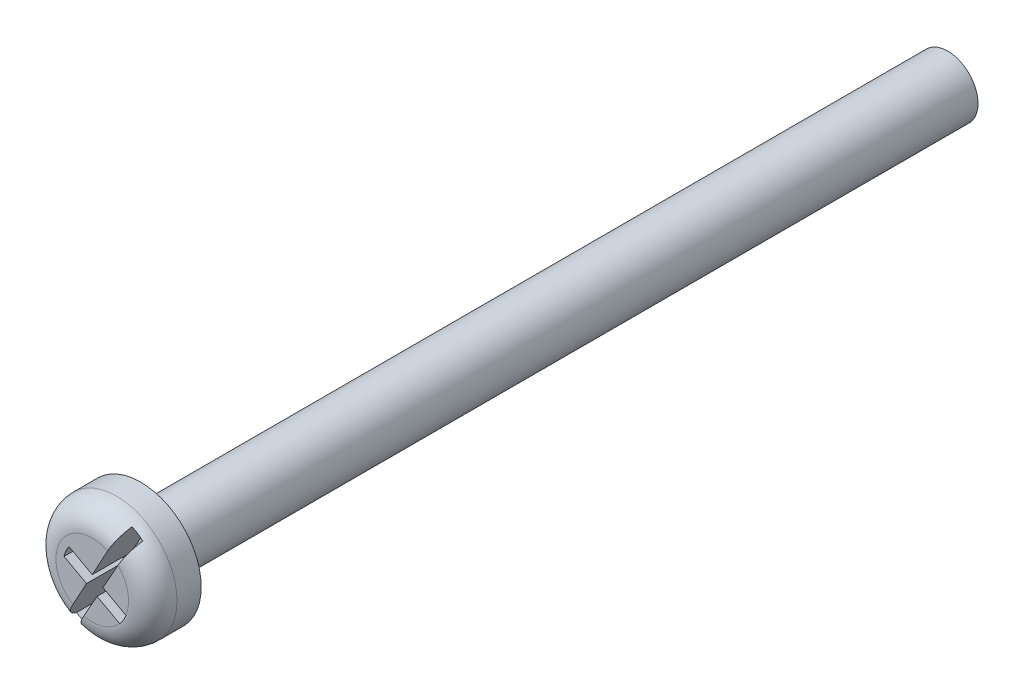
ISO-10303-21;
HEADER;
FILE_DESCRIPTION(('STEP AP214'),'2;1');
FILE_NAME('part.step','',(''),(''),'','','');
FILE_SCHEMA(('AUTOMOTIVE_DESIGN { 1 0 10303 214 1 1 1 1 }'));
ENDSEC;
DATA;
#1=APPLICATION_CONTEXT('core data for automotive mechanical design processes');
#2=APPLICATION_PROTOCOL_DEFINITION('international standard','automotive_design',2000,#1);
#3=PRODUCT_CONTEXT('',#1,'mechanical');
#4=PRODUCT('Part','Part','',(#3));
#5=PRODUCT_RELATED_PRODUCT_CATEGORY('part','',(#4));
#6=PRODUCT_DEFINITION_FORMATION('','',#4);
#7=PRODUCT_DEFINITION_CONTEXT('part definition',#1,'design');
#8=PRODUCT_DEFINITION('design','',#6,#7);
#9=PRODUCT_DEFINITION_SHAPE('','',#8);
#10=(LENGTH_UNIT() NAMED_UNIT(*) SI_UNIT(.MILLI.,.METRE.));
#11=(NAMED_UNIT(*) PLANE_ANGLE_UNIT() SI_UNIT($,.RADIAN.));
#12=(NAMED_UNIT(*) SI_UNIT($,.STERADIAN.) SOLID_ANGLE_UNIT());
#13=UNCERTAINTY_MEASURE_WITH_UNIT(LENGTH_MEASURE(1.E-05),#10,'distance_accuracy_value','');
#14=(GEOMETRIC_REPRESENTATION_CONTEXT(3) GLOBAL_UNCERTAINTY_ASSIGNED_CONTEXT((#13)) GLOBAL_UNIT_ASSIGNED_CONTEXT((#10,
#11,#12)) REPRESENTATION_CONTEXT('',''));
#15=CARTESIAN_POINT('',(0.,0.,0.));
#16=DIRECTION('',(0.,0.,1.));
#17=DIRECTION('',(1.,0.,0.));
#18=AXIS2_PLACEMENT_3D('',#15,#16,#17);
#19=CARTESIAN_POINT('',(-1.86051624597212,2.73214285714287,2.4));
#20=DIRECTION('',(0.,0.,1.));
#21=DIRECTION('',(1.,0.,0.));
#22=AXIS2_PLACEMENT_3D('',#19,#20,#21);
#23=PLANE('',#22);
#24=DIRECTION('',(-0.478292119632489,-0.87820080180871,0.));
#25=VECTOR('',#24,1.);
#26=CARTESIAN_POINT('',(-3.33454353016391,0.250826496084395,2.4));
#27=LINE('',#26,#25);
#28=CARTESIAN_POINT('',(-2.14514294385762,2.43470640062586,2.4));
#29=VERTEX_POINT('',#28);
#30=CARTESIAN_POINT('',(-2.8144800366458,1.20572447213714,2.4));
#31=VERTEX_POINT('',#30);
#32=EDGE_CURVE('E166',#29,#31,#27,.T.);
#33=ORIENTED_EDGE('',*,*,#32,.F.);
#34=DIRECTION('',(0.877616803209732,-0.479362854968896,0.));
#35=VECTOR('',#34,1.);
#36=CARTESIAN_POINT('',(-2.14514294385762,2.43470640062586,2.4));
#37=LINE('',#36,#35);
#38=CARTESIAN_POINT('',(-3.25868789679237,3.04293551135249,2.4));
#39=VERTEX_POINT('',#38);
#40=EDGE_CURVE('E168',#39,#29,#37,.T.);
#41=ORIENTED_EDGE('',*,*,#40,.F.);
#42=CARTESIAN_POINT('',(-1.86051624597212,2.73214285714287,2.4));
#43=DIRECTION('',(0.,0.,1.));
#44=DIRECTION('',(1.,0.,0.));
#45=AXIS2_PLACEMENT_3D('',#42,#43,#44);
#46=CIRCLE('',#45,1.43229746877807);
#47=CARTESIAN_POINT('',(-3.00946383602339,3.58735948138695,2.4));
#48=VERTEX_POINT('',#47);
#49=EDGE_CURVE('E209',#48,#39,#46,.T.);
#50=ORIENTED_EDGE('',*,*,#49,.F.);
#51=DIRECTION('',(-0.87756139574922,0.479464280933086,0.));
#52=VECTOR('',#51,1.);
#53=CARTESIAN_POINT('',(-1.85954831796557,2.95909185285404,2.4));
#54=LINE('',#53,#52);
#55=CARTESIAN_POINT('',(-1.85954831796557,2.95909185285404,2.4));
#56=VERTEX_POINT('',#55);
#57=EDGE_CURVE('E206',#56,#48,#54,.T.);
#58=ORIENTED_EDGE('',*,*,#57,.F.);
#59=DIRECTION('',(-0.478292119632489,-0.87820080180871,0.));
#60=VECTOR('',#59,1.);
#61=CARTESIAN_POINT('',(-1.85954831796557,2.95909185285404,2.4));
#62=LINE('',#61,#60);
#63=CARTESIAN_POINT('',(-1.09571318629089,4.36158333776873,2.4));
#64=VERTEX_POINT('',#63);
#65=EDGE_CURVE('E204',#64,#56,#62,.T.);
#66=ORIENTED_EDGE('',*,*,#65,.F.);
#67=CARTESIAN_POINT('',(-1.86051624597212,2.73214285714287,2.4));
#68=DIRECTION('',(0.,0.,1.));
#69=DIRECTION('',(1.,0.,0.));
#70=AXIS2_PLACEMENT_3D('',#67,#68,#69);
#71=CIRCLE('',#70,1.8);
#72=EDGE_CURVE('E254',#64,#31,#71,.T.);
#73=ORIENTED_EDGE('',*,*,#72,.T.);
#74=EDGE_LOOP('',(#33,#41,#50,#58,#66,#73));
#75=FACE_BOUND('',#74,.T.);
#76=ADVANCED_FACE('F34',(#75),#23,.T.);
#77=DIRECTION('',(0.488945551082672,0.872314305784596,0.));
#78=VECTOR('',#77,1.);
#79=CARTESIAN_POINT('',(-1.32937302466549,2.66942537823253,2.4));
#80=LINE('',#79,#78);
#81=CARTESIAN_POINT('',(-1.32937302466549,2.66942537823253,2.4));
#82=VERTEX_POINT('',#81);
#83=CARTESIAN_POINT('',(-0.583292168991765,4.00048770661469,2.4));
#84=VERTEX_POINT('',#83);
#85=EDGE_CURVE('E202',#82,#84,#80,.T.);
#86=ORIENTED_EDGE('',*,*,#85,.F.);
#87=DIRECTION('',(-0.87756139574922,0.479464280933086,0.));
#88=VECTOR('',#87,1.);
#89=CARTESIAN_POINT('',(-0.183967514701797,2.04362183688296,2.4));
#90=LINE('',#89,#88);
#91=CARTESIAN_POINT('',(-0.194936591049152,2.04961489939557,2.4));
#92=VERTEX_POINT('',#91);
#93=EDGE_CURVE('E200',#92,#82,#90,.T.);
#94=ORIENTED_EDGE('',*,*,#93,.F.);
#95=EDGE_CURVE('E250',#92,#84,#71,.T.);
#96=ORIENTED_EDGE('',*,*,#95,.T.);
#97=EDGE_LOOP('',(#86,#94,#96));
#98=FACE_BOUND('',#97,.T.);
#99=ADVANCED_FACE('F289',(#98),#23,.T.);
#100=CARTESIAN_POINT('',(-1.86051624597212,2.73214285714287,2.4));
#101=DIRECTION('',(0.,0.,-1.));
#102=DIRECTION('',(-1.,0.,0.));
#103=AXIS2_PLACEMENT_3D('',#100,#101,#102);
#104=CYLINDRICAL_SURFACE('',#103,3.);
#105=CARTESIAN_POINT('',(-1.86051624597212,2.73214285714287,1.2));
#106=DIRECTION('',(0.,0.,1.));
#107=DIRECTION('',(1.,0.,0.));
#108=AXIS2_PLACEMENT_3D('',#105,#106,#107);
#109=CIRCLE('',#108,3.);
#110=CARTESIAN_POINT('',(1.13948375402788,2.73214285714287,1.2));
#111=VERTEX_POINT('',#110);
#112=EDGE_CURVE('E255',#111,#111,#109,.F.);
#113=ORIENTED_EDGE('',*,*,#112,.T.);
#114=EDGE_LOOP('',(#113));
#115=FACE_BOUND('',#114,.T.);
#116=CARTESIAN_POINT('',(-1.86051624597212,2.73214285714287,0.));
#117=DIRECTION('',(0.,0.,1.));
#118=DIRECTION('',(1.,0.,0.));
#119=AXIS2_PLACEMENT_3D('',#116,#117,#118);
#120=CIRCLE('',#119,3.);
#121=CARTESIAN_POINT('',(1.13948375402788,2.73214285714287,0.));
#122=VERTEX_POINT('',#121);
#123=EDGE_CURVE('E244',#122,#122,#120,.T.);
#124=ORIENTED_EDGE('',*,*,#123,.T.);
#125=EDGE_LOOP('',(#124));
#126=FACE_BOUND('',#125,.T.);
#127=ADVANCED_FACE('F287',(#115,#126),#104,.T.);
#128=DIRECTION('',(0.877616803209732,-0.479362854968895,0.));
#129=VECTOR('',#128,1.);
#130=CARTESIAN_POINT('',(-0.499159615510704,1.53565425779784,2.4));
#131=LINE('',#130,#129);
#132=CARTESIAN_POINT('',(-1.62131210840641,2.14858489077753,2.4));
#133=VERTEX_POINT('',#132);
#134=CARTESIAN_POINT('',(-0.510336160729363,1.54175899577131,2.4));
#135=VERTEX_POINT('',#134);
#136=EDGE_CURVE('E198',#133,#135,#131,.T.);
#137=ORIENTED_EDGE('',*,*,#136,.F.);
#138=DIRECTION('',(0.488945551082672,0.872314305784596,0.));
#139=VECTOR('',#138,1.);
#140=CARTESIAN_POINT('',(-2.81993360779638,0.0101572502690064,2.4));
#141=LINE('',#140,#139);
#142=CARTESIAN_POINT('',(-2.27591252151725,0.980730303155878,2.4));
#143=VERTEX_POINT('',#142);
#144=EDGE_CURVE('E196',#143,#133,#141,.T.);
#145=ORIENTED_EDGE('',*,*,#144,.F.);
#146=EDGE_CURVE('E253',#143,#135,#71,.T.);
#147=ORIENTED_EDGE('',*,*,#146,.T.);
#148=EDGE_LOOP('',(#137,#145,#147));
#149=FACE_BOUND('',#148,.T.);
#150=ADVANCED_FACE('F284',(#149),#23,.T.);
#151=CARTESIAN_POINT('',(-1.86051624597212,2.73214285714287,0.));
#152=DIRECTION('',(0.,0.,1.));
#153=DIRECTION('',(1.,0.,0.));
#154=AXIS2_PLACEMENT_3D('',#151,#152,#153);
#155=PLANE('',#154);
#156=CARTESIAN_POINT('',(-1.86051624597212,2.73214285714287,0.));
#157=DIRECTION('',(0.,0.,1.));
#158=DIRECTION('',(1.,0.,0.));
#159=AXIS2_PLACEMENT_3D('',#156,#157,#158);
#160=CIRCLE('',#159,1.5);
#161=CARTESIAN_POINT('',(-0.360516245972119,2.73214285714287,0.));
#162=VERTEX_POINT('',#161);
#163=EDGE_CURVE('E247',#162,#162,#160,.F.);
#164=ORIENTED_EDGE('',*,*,#163,.F.);
#165=EDGE_LOOP('',(#164));
#166=FACE_BOUND('',#165,.T.);
#167=ORIENTED_EDGE('',*,*,#123,.F.);
#168=EDGE_LOOP('',(#167));
#169=FACE_BOUND('',#168,.T.);
#170=ADVANCED_FACE('F282',(#166,#169),#155,.F.);
#171=CARTESIAN_POINT('',(-1.86051624597212,2.73214285714287,-40.));
#172=DIRECTION('',(0.,0.,1.));
#173=DIRECTION('',(1.,0.,0.));
#174=AXIS2_PLACEMENT_3D('',#171,#172,#173);
#175=CYLINDRICAL_SURFACE('',#174,1.5);
#176=CARTESIAN_POINT('',(-1.86051624597212,2.73214285714287,-40.));
#177=DIRECTION('',(0.,0.,-1.));
#178=DIRECTION('',(-1.,0.,0.));
#179=AXIS2_PLACEMENT_3D('',#176,#177,#178);
#180=CIRCLE('',#179,1.5);
#181=CARTESIAN_POINT('',(-3.36051624597212,2.73214285714287,-40.));
#182=VERTEX_POINT('',#181);
#183=EDGE_CURVE('E216',#182,#182,#180,.T.);
#184=ORIENTED_EDGE('',*,*,#183,.F.);
#185=EDGE_LOOP('',(#184));
#186=FACE_BOUND('',#185,.T.);
#187=ORIENTED_EDGE('',*,*,#163,.T.);
#188=EDGE_LOOP('',(#187));
#189=FACE_BOUND('',#188,.T.);
#190=ADVANCED_FACE('F278',(#186,#189),#175,.T.);
#191=CARTESIAN_POINT('',(-1.86051624597212,2.73214285714287,-40.));
#192=DIRECTION('',(0.,0.,-1.));
#193=DIRECTION('',(-1.,0.,0.));
#194=AXIS2_PLACEMENT_3D('',#191,#192,#193);
#195=PLANE('',#194);
#196=ORIENTED_EDGE('',*,*,#183,.T.);
#197=EDGE_LOOP('',(#196));
#198=FACE_BOUND('',#197,.T.);
#199=ADVANCED_FACE('F275',(#198),#195,.T.);
#200=CARTESIAN_POINT('',(-1.86051624597212,2.73214285714287,1.2));
#201=DIRECTION('',(0.,0.,1.));
#202=DIRECTION('',(1.,0.,0.));
#203=AXIS2_PLACEMENT_3D('',#200,#201,#202);
#204=TOROIDAL_SURFACE('',#203,1.8,1.2);
#205=CARTESIAN_POINT('',(-0.575540767315494,5.31668131382147,1.70975429270533));
#206=CARTESIAN_POINT('',(-0.5824043740871,5.3040789214284,1.74031456902629));
#207=CARTESIAN_POINT('',(-0.58988200536983,5.29034910753732,1.77025412843296));
#208=CARTESIAN_POINT('',(-0.606016263850412,5.26072470405536,1.82870871238285));
#209=CARTESIAN_POINT('',(-0.614672831189766,5.24483022437174,1.85722380915036));
#210=CARTESIAN_POINT('',(-0.642308509018158,5.19408785703759,1.94027220578123));
#211=CARTESIAN_POINT('',(-0.6629762437161,5.15613945596996,1.99240919048908));
#212=CARTESIAN_POINT('',(-0.708203159379022,5.07309749903989,2.08868631517981));
#213=CARTESIAN_POINT('',(-0.732764089691729,5.02800073116848,2.1328228410772));
#214=CARTESIAN_POINT('',(-0.785077689775711,4.931946784943,2.21185265354796));
#215=CARTESIAN_POINT('',(-0.812829752078776,4.88099072197227,2.24674769517889));
#216=CARTESIAN_POINT('',(-0.870755055483799,4.77463302589651,2.30632883547805));
#217=CARTESIAN_POINT('',(-0.900929651552919,4.71922890491179,2.33100917270618));
#218=CARTESIAN_POINT('',(-0.96283568336023,4.6055621214997,2.3694469225507));
#219=CARTESIAN_POINT('',(-0.994567368093604,4.54729900188777,2.38320258211041));
#220=CARTESIAN_POINT('',(-1.05872386347642,4.42950010164723,2.39941483191493));
#221=CARTESIAN_POINT('',(-1.09114948115231,4.36996283922278,2.40185745763308));
#222=CARTESIAN_POINT('',(-1.15573526747496,4.25137571013191,2.3953503202161));
#223=CARTESIAN_POINT('',(-1.18789545531375,4.19232580822668,2.38640138814567));
#224=CARTESIAN_POINT('',(-1.25111142223883,4.07625382927923,2.35735083248507));
#225=CARTESIAN_POINT('',(-1.28216478936063,4.01923618088856,2.33722626866415));
#226=CARTESIAN_POINT('',(-1.34222441899033,3.90895960987239,2.28639254421336));
#227=CARTESIAN_POINT('',(-1.37123050343914,3.85570101418436,2.25568246428877));
#228=CARTESIAN_POINT('',(-1.42645974489832,3.75429360615512,2.18445449366384));
#229=CARTESIAN_POINT('',(-1.45267457095233,3.7061600904334,2.14390836466459));
#230=CARTESIAN_POINT('',(-1.50148430909094,3.6165396484275,2.05421363754392));
#231=CARTESIAN_POINT('',(-1.52407946375269,3.57505227674305,2.00506561635217));
#232=CARTESIAN_POINT('',(-1.56505668794341,3.49981325510113,1.89942416088343));
#233=CARTESIAN_POINT('',(-1.58342918956016,3.46607917296016,1.84291449103487));
#234=CARTESIAN_POINT('',(-1.61535277583557,3.40746369945995,1.72423224566163));
#235=CARTESIAN_POINT('',(-1.62890390546596,3.38258222552731,1.66205972296445));
#236=CARTESIAN_POINT('',(-1.65068064383632,3.3425975627812,1.53419605152068));
#237=CARTESIAN_POINT('',(-1.65894166858414,3.32742934599587,1.46853155927476));
#238=CARTESIAN_POINT('',(-1.66723338993673,3.31220476661996,1.36857431614967));
#239=CARTESIAN_POINT('',(-1.66931401785529,3.30838448810952,1.33497508943135));
#240=CARTESIAN_POINT('',(-1.67209007621539,3.30328731720154,1.26752282072818));
#241=CARTESIAN_POINT('',(-1.67278531621524,3.30201077447743,1.23366974448996));
#242=CARTESIAN_POINT('',(-1.67278220669648,3.302016483921,1.1998));
#243=B_SPLINE_CURVE_WITH_KNOTS('',3,(#205,#206,#207,#208,#209,#210,#211,#212,#213,#214,#215,
#216,#217,#218,#219,#220,#221,#222,#223,#224,#225,#226,#227,#228,#229,#230,#231,#232,#233,#234,
#235,#236,#237,#238,#239,#240,#241,#242),.UNSPECIFIED.,.F.,.F.,(4,2,2,2,2,2,2,2,2,2,2,2,2,2,2,2,
2,2,4),(0.,0.101223158894359,0.202441180267574,0.404547966509414,0.606745825117994,
0.808905256591363,1.01117855796459,1.21348431109243,1.41603971895592,1.61858035035038,
1.82153828216889,2.02451384422666,2.22807917195367,2.43163085176484,2.63563930015266,
2.83964584558596,3.04227192850753,3.1438024334223,3.24534689421735),.UNSPECIFIED.);
#244=CARTESIAN_POINT('',(-0.575649692772779,5.31648131382147,1.71023901109821));
#245=VERTEX_POINT('',#244);
#246=EDGE_CURVE('E11',#245,#64,#243,.T.);
#247=ORIENTED_EDGE('',*,*,#246,.F.);
#248=CARTESIAN_POINT('',(-1.86051624597212,2.73214285714287,1.71023901109821));
#249=DIRECTION('',(0.,0.,-1.));
#250=DIRECTION('',(-1.,0.,0.));
#251=AXIS2_PLACEMENT_3D('',#248,#249,#250);
#252=CIRCLE('',#251,2.88611976851244);
#253=CARTESIAN_POINT('',(-0.0392710827126332,4.97106075950156,1.71023901109827));
#254=VERTEX_POINT('',#253);
#255=EDGE_CURVE('E47',#254,#245,#252,.F.);
#256=ORIENTED_EDGE('',*,*,#255,.F.);
#257=CARTESIAN_POINT('',(-1.26309170389054,2.78767605909107,1.1998));
#258=CARTESIAN_POINT('',(-1.2631127720155,2.78763847202896,1.22576998040815));
#259=CARTESIAN_POINT('',(-1.26237301012876,2.78895826085872,1.25170198029709));
#260=CARTESIAN_POINT('',(-1.25952072671015,2.79404694123365,1.30315668634531));
#261=CARTESIAN_POINT('',(-1.25741325248622,2.79780682801559,1.32868054522842));
#262=CARTESIAN_POINT('',(-1.24932506804159,2.81223673536059,1.40375196214292));
#263=CARTESIAN_POINT('',(-1.24157094586872,2.8260706513973,1.45250594024511));
#264=CARTESIAN_POINT('',(-1.22556622491573,2.8546242337266,1.53282213605265));
#265=CARTESIAN_POINT('',(-1.21816574900715,2.86782721919272,1.56514626066184));
#266=CARTESIAN_POINT('',(-1.20205095375697,2.89657718204726,1.62840310857575));
#267=CARTESIAN_POINT('',(-1.19333633706057,2.9121246899382,1.65933551490998));
#268=CARTESIAN_POINT('',(-1.16542086668087,2.96192791263038,1.75044821489817));
#269=CARTESIAN_POINT('',(-1.14454383968645,2.99917404212099,1.80849742576797));
#270=CARTESIAN_POINT('',(-1.09772220899005,3.08270722528668,1.92199684801045));
#271=CARTESIAN_POINT('',(-1.07153445687538,3.12942807335531,1.9770243073677));
#272=CARTESIAN_POINT('',(-1.01564250198845,3.22914337236595,2.07869204050147));
#273=CARTESIAN_POINT('',(-0.985948470618887,3.28211967678826,2.12535563158695));
#274=CARTESIAN_POINT('',(-0.918223441287482,3.40294603836298,2.21601487520697));
#275=CARTESIAN_POINT('',(-0.879627663676285,3.47180370334956,2.25827105625763));
#276=CARTESIAN_POINT('',(-0.799196938468586,3.61529794737724,2.32733623557769));
#277=CARTESIAN_POINT('',(-0.75735970921051,3.68993859706798,2.35413423868104));
#278=CARTESIAN_POINT('',(-0.676058999745624,3.83498495607384,2.38861679562639));
#279=CARTESIAN_POINT('',(-0.636757731729013,3.90510126708322,2.39790034547785));
#280=CARTESIAN_POINT('',(-0.558000185780485,4.04561043802723,2.40146077706672));
#281=CARTESIAN_POINT('',(-0.518544054122394,4.11600303699876,2.39574945908726));
#282=CARTESIAN_POINT('',(-0.444261504767299,4.24852848963682,2.3702843287041));
#283=CARTESIAN_POINT('',(-0.409330772893901,4.31084744735557,2.35179428040256));
#284=CARTESIAN_POINT('',(-0.341616033942729,4.43165545014603,2.30246954631037));
#285=CARTESIAN_POINT('',(-0.308831410977736,4.49014559400518,2.27163842037526));
#286=CARTESIAN_POINT('',(-0.248009519737374,4.59865625683126,2.20022273119116));
#287=CARTESIAN_POINT('',(-0.219819428476118,4.64894942308283,2.16018125447389));
#288=CARTESIAN_POINT('',(-0.167249114151315,4.74273867455178,2.0707446602969));
#289=CARTESIAN_POINT('',(-0.142866729021386,4.78623861705231,2.02135488642782));
#290=CARTESIAN_POINT('',(-0.10452820364559,4.85463732540325,1.92879061961627));
#291=CARTESIAN_POINT('',(-0.08951899805589,4.88141483616159,1.88741844310844));
#292=CARTESIAN_POINT('',(-0.0622349441551543,4.93009156608522,1.80110482457957));
#293=CARTESIAN_POINT('',(-0.0499580968395804,4.95199435161951,1.75616602478609));
#294=CARTESIAN_POINT('',(-0.0391589796443221,4.97126075950155,1.70975788936457));
#295=B_SPLINE_CURVE_WITH_KNOTS('',3,(#257,#258,#259,#260,#261,#262,#263,#264,#265,#266,#267,
#268,#269,#270,#271,#272,#273,#274,#275,#276,#277,#278,#279,#280,#281,#282,#283,#284,#285,#286,
#287,#288,#289,#290,#291,#292,#293,#294),.UNSPECIFIED.,.F.,.F.,(4,2,2,2,2,2,2,2,2,2,2,2,2,2,2,2,
2,2,4),(0.,0.0778006917118378,0.155315893483458,0.308266870217621,0.415234357270093,
0.522226084613864,0.737655839714488,0.967269406588131,1.19623253348757,1.46333863997643,
1.73063450143458,1.97205770050909,2.21329096739737,2.43355558113201,2.65375670399323,
2.86332090395877,3.07276567449364,3.22690773757732,3.38093665626108),.UNSPECIFIED.);
#296=EDGE_CURVE('E355',#84,#254,#295,.T.);
#297=ORIENTED_EDGE('',*,*,#296,.F.);
#298=ORIENTED_EDGE('',*,*,#95,.F.);
#299=CARTESIAN_POINT('',(-0.183767514701797,2.04351256492016,2.39993332802436));
#300=CARTESIAN_POINT('',(-0.217782658736837,2.06209707268747,2.40033863472729));
#301=CARTESIAN_POINT('',(-0.251792157132213,2.08067849590415,2.39888813616958));
#302=CARTESIAN_POINT('',(-0.319534364168039,2.11769011553849,2.39230484226138));
#303=CARTESIAN_POINT('',(-0.353267082920302,2.13612031748085,2.38717218204555));
#304=CARTESIAN_POINT('',(-0.453400795391146,2.19082935399903,2.36634775777888));
#305=CARTESIAN_POINT('',(-0.519000364428353,2.22667032233503,2.34523208484704));
#306=CARTESIAN_POINT('',(-0.638425774554932,2.29191956719567,2.2925053228282));
#307=CARTESIAN_POINT('',(-0.69274889876274,2.32159953923238,2.26232665392895));
#308=CARTESIAN_POINT('',(-0.796253299526463,2.37815018437923,2.19212147821412));
#309=CARTESIAN_POINT('',(-0.845435603131863,2.40502141862793,2.1520969438157));
#310=CARTESIAN_POINT('',(-0.93783514695995,2.45550481620521,2.0628344484937));
#311=CARTESIAN_POINT('',(-0.980978593060597,2.47907666139099,2.01349735883978));
#312=CARTESIAN_POINT('',(-1.05943191653211,2.5219404046086,1.90725218211608));
#313=CARTESIAN_POINT('',(-1.09473743753789,2.5412299224976,1.85033991268358));
#314=CARTESIAN_POINT('',(-1.15640863612218,2.57492458708373,1.73042207813507));
#315=CARTESIAN_POINT('',(-1.18276106492887,2.58932249518434,1.66740765860267));
#316=CARTESIAN_POINT('',(-1.22535753184498,2.61259549292461,1.53714360818663));
#317=CARTESIAN_POINT('',(-1.24161903914605,2.62148012702857,1.46990151973345));
#318=CARTESIAN_POINT('',(-1.25768366139594,2.6302571910526,1.36830312947122));
#319=CARTESIAN_POINT('',(-1.26165056048128,2.63242454529892,1.33474662578359));
#320=CARTESIAN_POINT('',(-1.266942961413,2.63531610048746,1.26739967422531));
#321=CARTESIAN_POINT('',(-1.26827119793696,2.6360417955476,1.23360950501902));
#322=CARTESIAN_POINT('',(-1.26826312586215,2.63603738529031,1.1998));
#323=B_SPLINE_CURVE_WITH_KNOTS('',3,(#299,#300,#301,#302,#303,#304,#305,#306,#307,#308,#309,
#310,#311,#312,#313,#314,#315,#316,#317,#318,#319,#320,#321,#322),.UNSPECIFIED.,.F.,.F.,(4,2,2,
2,2,2,2,2,2,2,2,4),(0.,0.116194057201358,0.232383850320403,0.463878668865414,0.66956690126712,
0.875213961759851,1.08318799595766,1.29127733555275,1.49967327769664,1.70770743525587,
1.80916908072369,1.91052551761236),.UNSPECIFIED.);
#324=CARTESIAN_POINT('',(-0.183967514701797,2.04362183688296,2.39993569454367));
#325=VERTEX_POINT('',#324);
#326=EDGE_CURVE('E360',#325,#92,#323,.T.);
#327=ORIENTED_EDGE('',*,*,#326,.F.);
#328=CARTESIAN_POINT('',(-1.86051624597212,2.73214285714287,2.39993569454367));
#329=DIRECTION('',(0.,0.,-1.));
#330=DIRECTION('',(-1.,0.,0.));
#331=AXIS2_PLACEMENT_3D('',#328,#329,#330);
#332=CIRCLE('',#331,1.81242292075108);
#333=CARTESIAN_POINT('',(-0.499159615510704,1.53565425779784,2.39993569454353));
#334=VERTEX_POINT('',#333);
#335=EDGE_CURVE('E313',#334,#325,#332,.F.);
#336=ORIENTED_EDGE('',*,*,#335,.F.);
#337=CARTESIAN_POINT('',(-1.62151210840638,2.14869413272758,1.46884807485071));
#338=CARTESIAN_POINT('',(-1.61337014202699,2.14424691130428,1.50015816020714));
#339=CARTESIAN_POINT('',(-1.60395340171439,2.13910339592918,1.53100343533154));
#340=CARTESIAN_POINT('',(-1.58283284504561,2.12756714194424,1.59162369108894));
#341=CARTESIAN_POINT('',(-1.57113159541627,2.12117580530562,1.62139982889169));
#342=CARTESIAN_POINT('',(-1.53304521941817,2.10037265538062,1.70882633846756));
#343=CARTESIAN_POINT('',(-1.50362091999362,2.08430081613823,1.76478080452301));
#344=CARTESIAN_POINT('',(-1.43685873996878,2.0478346624552,1.87328351003643));
#345=CARTESIAN_POINT('',(-1.39926537871097,2.02730080198841,1.92562519772884));
#346=CARTESIAN_POINT('',(-1.31781577832807,1.98281223609858,2.02368680610002));
#347=CARTESIAN_POINT('',(-1.27395030371921,1.95885248616424,2.06939675818379));
#348=CARTESIAN_POINT('',(-1.17347767984285,1.90397335936148,2.15971584324997));
#349=CARTESIAN_POINT('',(-1.11595236120694,1.87255246943155,2.2030105340935));
#350=CARTESIAN_POINT('',(-0.99525776678779,1.80662790514737,2.27762475239334));
#351=CARTESIAN_POINT('',(-0.93209357834735,1.77212700954936,2.30895494207597));
#352=CARTESIAN_POINT('',(-0.807854099588225,1.70426619487488,2.35608316652604));
#353=CARTESIAN_POINT('',(-0.747121541030133,1.67109347922781,2.37304527651785));
#354=CARTESIAN_POINT('',(-0.654777795629045,1.6206544251075,2.38976872479177));
#355=CARTESIAN_POINT('',(-0.623736747104048,1.6036995017426,2.39388947843407));
#356=CARTESIAN_POINT('',(-0.561450947954723,1.56967839093998,2.39915564694617));
#357=CARTESIAN_POINT('',(-0.530206133741795,1.55261216876954,2.40030008361231));
#358=CARTESIAN_POINT('',(-0.498959615510704,1.53554501584778,2.39993337202856));
#359=B_SPLINE_CURVE_WITH_KNOTS('',3,(#337,#338,#339,#340,#341,#342,#343,#344,#345,#346,#347,
#348,#349,#350,#351,#352,#353,#354,#355,#356,#357,#358),.UNSPECIFIED.,.F.,.F.,(4,2,2,2,2,2,2,2,
2,2,4),(0.,0.0978774872130326,0.195645631969167,0.390542213792294,0.592750808490968,
0.795260275068813,1.02975854366474,1.26404734754404,1.47677448793309,1.58349124104491,
1.69024306351729),.UNSPECIFIED.);
#360=EDGE_CURVE('E312',#135,#334,#359,.T.);
#361=ORIENTED_EDGE('',*,*,#360,.F.);
#362=ORIENTED_EDGE('',*,*,#146,.F.);
#363=CARTESIAN_POINT('',(-2.8200457108647,0.00995725026900685,1.70975788936454));
#364=CARTESIAN_POINT('',(-2.81294284402451,0.022629279584052,1.74025937821588));
#365=CARTESIAN_POINT('',(-2.80520776699475,0.0364292177048946,1.77012651441064));
#366=CARTESIAN_POINT('',(-2.78852805075133,0.0661870405613481,1.82840858711255));
#367=CARTESIAN_POINT('',(-2.77958354431484,0.0821446884128344,1.85682368256077));
#368=CARTESIAN_POINT('',(-2.75105867197416,0.133035128377685,1.93950073195886));
#369=CARTESIAN_POINT('',(-2.72975432624299,0.171043625470118,1.99133402140313));
#370=CARTESIAN_POINT('',(-2.68321245334617,0.254077700442272,2.08695288085192));
#371=CARTESIAN_POINT('',(-2.65797425673365,0.299104472663766,2.13073707832536));
#372=CARTESIAN_POINT('',(-2.60429647966901,0.394869517938271,2.20913797564933));
#373=CARTESIAN_POINT('',(-2.57585694671416,0.445607706252732,2.24375481148769));
#374=CARTESIAN_POINT('',(-2.51624584523596,0.551958232375456,2.30332144687179));
#375=CARTESIAN_POINT('',(-2.48504637325386,0.607620351976805,2.32815425531122));
#376=CARTESIAN_POINT('',(-2.42108372755138,0.721734348430112,2.36706399353599));
#377=CARTESIAN_POINT('',(-2.38832028354668,0.780186707488876,2.38113905697485));
#378=CARTESIAN_POINT('',(-2.3212205298552,0.899897531997037,2.39860255480028));
#379=CARTESIAN_POINT('',(-2.28686565282517,0.961189122932676,2.40169129859643));
#380=CARTESIAN_POINT('',(-2.21836196694208,1.08340466423881,2.39656212253163));
#381=CARTESIAN_POINT('',(-2.18421320380919,1.14432853304119,2.38834178043095));
#382=CARTESIAN_POINT('',(-2.11541314916736,1.26707281769608,2.36052733205186));
#383=CARTESIAN_POINT('',(-2.08081091742779,1.32880570736378,2.34042775974803));
#384=CARTESIAN_POINT('',(-2.01358345624662,1.4487443712908,2.28946888113319));
#385=CARTESIAN_POINT('',(-1.98095779999344,1.5069509070129,2.25861190751046));
#386=CARTESIAN_POINT('',(-1.91595930201837,1.6229129390073,2.1846794657163));
#387=CARTESIAN_POINT('',(-1.88378883195749,1.68030738956684,2.14086134133571));
#388=CARTESIAN_POINT('',(-1.82299040998259,1.78877618152209,2.04373589253331));
#389=CARTESIAN_POINT('',(-1.79437078554514,1.83983566609596,1.99040695083443));
#390=CARTESIAN_POINT('',(-1.74170793806781,1.93379000341657,1.87684814417621));
#391=CARTESIAN_POINT('',(-1.71758927738487,1.97681944238683,1.81676563764669));
#392=CARTESIAN_POINT('',(-1.68499473938053,2.03497046089731,1.72173769517997));
#393=CARTESIAN_POINT('',(-1.67474067883886,2.05326444819932,1.68930008901254));
#394=CARTESIAN_POINT('',(-1.65560220426437,2.0874088741487,1.62278687505944));
#395=CARTESIAN_POINT('',(-1.64671642517575,2.10326174815456,1.58871294486205));
#396=CARTESIAN_POINT('',(-1.6354763758506,2.12331481091859,1.53995134726292));
#397=CARTESIAN_POINT('',(-1.63241040549437,2.12878472427997,1.52594181495768));
#398=CARTESIAN_POINT('',(-1.62657512176459,2.13919529344156,1.49766364899058));
#399=CARTESIAN_POINT('',(-1.62380587038182,2.14413583864574,1.48339496191127));
#400=CARTESIAN_POINT('',(-1.6212000053383,2.14878489077715,1.46899770049256));
#401=B_SPLINE_CURVE_WITH_KNOTS('',3,(#363,#364,#365,#366,#367,#368,#369,#370,#371,#372,#373,
#374,#375,#376,#377,#378,#379,#380,#381,#382,#383,#384,#385,#386,#387,#388,#389,#390,#391,#392,
#393,#394,#395,#396,#397,#398,#399,#400),.UNSPECIFIED.,.F.,.F.,(4,2,2,2,2,2,2,2,2,2,2,2,2,2,2,2,
2,2,4),(0.,0.101288992601227,0.202566874207223,0.404664504390113,0.606796564357891,
0.808925625748703,1.01340315711687,1.21791615496524,1.42796691929092,1.63806268040327,
1.85781625970006,2.07752221615008,2.31370147648449,2.5504245572661,2.78272989816584,
2.89851304910329,3.0141799308455,3.06021461907438,3.10625890623177),.UNSPECIFIED.);
#402=CARTESIAN_POINT('',(-2.81993360779156,0.0101572502776019,1.71023901111888));
#403=VERTEX_POINT('',#402);
#404=EDGE_CURVE('E258',#403,#143,#401,.T.);
#405=ORIENTED_EDGE('',*,*,#404,.F.);
#406=CARTESIAN_POINT('',(-1.86051624597212,2.73214285714287,1.71023901109822));
#407=DIRECTION('',(0.,0.,-1.));
#408=DIRECTION('',(-1.,0.,0.));
#409=AXIS2_PLACEMENT_3D('',#406,#407,#408);
#410=CIRCLE('',#409,2.88611976851244);
#411=CARTESIAN_POINT('',(-3.33454353016391,0.250826496084395,1.71023901109839));
#412=VERTEX_POINT('',#411);
#413=EDGE_CURVE('E149',#412,#403,#410,.F.);
#414=ORIENTED_EDGE('',*,*,#413,.F.);
#415=CARTESIAN_POINT('',(-2.23741101624021,2.26529132598487,1.1998));
#416=CARTESIAN_POINT('',(-2.23740798207602,2.26529689706855,1.23311773914182));
#417=CARTESIAN_POINT('',(-2.23808067093128,2.26406176090843,1.26641957114974));
#418=CARTESIAN_POINT('',(-2.24076710911818,2.25912914321957,1.33278175952951));
#419=CARTESIAN_POINT('',(-2.242780689134,2.25543197257465,1.36584214585618));
#420=CARTESIAN_POINT('',(-2.25080606757614,2.24069643022843,1.46421986667473));
#421=CARTESIAN_POINT('',(-2.25880259100748,2.22601386908886,1.52887702678378));
#422=CARTESIAN_POINT('',(-2.27983915454845,2.18738825471918,1.65459016266913));
#423=CARTESIAN_POINT('',(-2.29288843169437,2.16342824119987,1.71563930558337));
#424=CARTESIAN_POINT('',(-2.32363131516378,2.10698067745266,1.83240079175109));
#425=CARTESIAN_POINT('',(-2.34132519302719,2.07449262864539,1.88811282271796));
#426=CARTESIAN_POINT('',(-2.38115513632148,2.00136015018449,1.99348291171297));
#427=CARTESIAN_POINT('',(-2.40335437218142,1.96059973216481,2.04303659878605));
#428=CARTESIAN_POINT('',(-2.4513978021071,1.87238632251299,2.13371393052453));
#429=CARTESIAN_POINT('',(-2.47724247281079,1.82493245571732,2.17483647109585));
#430=CARTESIAN_POINT('',(-2.53202000366664,1.72435444168758,2.24770555401301));
#431=CARTESIAN_POINT('',(-2.5609706987514,1.67119754741156,2.27939351984365));
#432=CARTESIAN_POINT('',(-2.62100717148868,1.5609634951839,2.3321349510837));
#433=CARTESIAN_POINT('',(-2.65209280048278,1.50388661018668,2.35318915608555));
#434=CARTESIAN_POINT('',(-2.715459985346,1.38753697725104,2.38402091071262));
#435=CARTESIAN_POINT('',(-2.74773931345678,1.32826831973999,2.39381847050695));
#436=CARTESIAN_POINT('',(-2.81262891214323,1.20912335527922,2.40190903095553));
#437=CARTESIAN_POINT('',(-2.84523920539102,1.1492470067008,2.40020123807361));
#438=CARTESIAN_POINT('',(-2.90976172307835,1.03077604629428,2.3853359072085));
#439=CARTESIAN_POINT('',(-2.94167569398232,0.972178227751287,2.37221150496673));
#440=CARTESIAN_POINT('',(-3.00398675295645,0.857767766640874,2.33492525045804));
#441=CARTESIAN_POINT('',(-3.03438411411032,0.801954622659517,2.31076539327067));
#442=CARTESIAN_POINT('',(-3.09273596313708,0.6948137384616,2.2521514303079));
#443=CARTESIAN_POINT('',(-3.12069564895239,0.64347645420905,2.21771995706866));
#444=CARTESIAN_POINT('',(-3.1734523737464,0.546608878697876,2.13952114974382));
#445=CARTESIAN_POINT('',(-3.19824869151269,0.501079911670375,2.09575169275951));
#446=CARTESIAN_POINT('',(-3.2445007498667,0.416155671724698,1.99898020102851));
#447=CARTESIAN_POINT('',(-3.2658668259731,0.376925033380575,1.94578943219456));
#448=CARTESIAN_POINT('',(-3.29438735791881,0.324557969415617,1.86087349664456));
#449=CARTESIAN_POINT('',(-3.30331296750969,0.308169496393382,1.83168275144308));
#450=CARTESIAN_POINT('',(-3.31992520204965,0.277667472433556,1.77179737413023));
#451=CARTESIAN_POINT('',(-3.32761178275446,0.263554002733655,1.74110268836594));
#452=CARTESIAN_POINT('',(-3.3346524556212,0.250626496084396,1.70975429270533));
#453=B_SPLINE_CURVE_WITH_KNOTS('',3,(#415,#416,#417,#418,#419,#420,#421,#422,#423,#424,#425,
#426,#427,#428,#429,#430,#431,#432,#433,#434,#435,#436,#437,#438,#439,#440,#441,#442,#443,#444,
#445,#446,#447,#448,#449,#450,#451,#452),.UNSPECIFIED.,.F.,.F.,(4,2,2,2,2,2,2,2,2,2,2,2,2,2,2,2,
2,2,4),(0.,0.0998914587792622,0.199770306544799,0.39910369637716,0.59880322511113,
0.798514431593275,1.00124780839576,1.20400771705243,1.40800143848499,1.61198096992408,
1.81559733711599,2.01922774808509,2.22226910362057,2.42527376620348,2.62783439007704,
2.83044111327975,3.03769485368784,3.14152109707258,3.24535104714929),.UNSPECIFIED.);
#454=EDGE_CURVE('E62',#31,#412,#453,.T.);
#455=ORIENTED_EDGE('',*,*,#454,.F.);
#456=ORIENTED_EDGE('',*,*,#72,.F.);
#457=EDGE_LOOP('',(#247,#256,#297,#298,#327,#336,#361,#362,#405,#414,#455,#456));
#458=FACE_BOUND('',#457,.T.);
#459=ORIENTED_EDGE('',*,*,#112,.F.);
#460=EDGE_LOOP('',(#459));
#461=FACE_BOUND('',#460,.T.);
#462=ADVANCED_FACE('F36',(#458,#461),#204,.T.);
#463=CARTESIAN_POINT('',(-1.86051624597212,2.73214285714287,0.46));
#464=DIRECTION('',(0.,0.,1.));
#465=DIRECTION('',(1.,0.,0.));
#466=AXIS2_PLACEMENT_3D('',#463,#464,#465);
#467=CYLINDRICAL_SURFACE('',#466,2.88611976851244);
#468=ORIENTED_EDGE('',*,*,#413,.T.);
#469=DIRECTION('',(0.,0.,1.));
#470=VECTOR('',#469,1.);
#471=CARTESIAN_POINT('',(-2.81993360779638,0.0101572502690064,0.46));
#472=LINE('',#471,#470);
#473=CARTESIAN_POINT('',(-2.81993360779638,0.0101572502690064,0.46));
#474=VERTEX_POINT('',#473);
#475=EDGE_CURVE('E54',#474,#403,#472,.T.);
#476=ORIENTED_EDGE('',*,*,#475,.F.);
#477=CARTESIAN_POINT('',(-1.86051624597212,2.73214285714287,0.46));
#478=DIRECTION('',(0.,0.,1.));
#479=DIRECTION('',(1.,0.,0.));
#480=AXIS2_PLACEMENT_3D('',#477,#478,#479);
#481=CIRCLE('',#480,2.88611976851244);
#482=CARTESIAN_POINT('',(-3.33454353016391,0.250826496084395,0.46));
#483=VERTEX_POINT('',#482);
#484=EDGE_CURVE('E146',#483,#474,#481,.T.);
#485=ORIENTED_EDGE('',*,*,#484,.F.);
#486=DIRECTION('',(0.,0.,1.));
#487=VECTOR('',#486,1.);
#488=CARTESIAN_POINT('',(-3.33454353016391,0.250826496084395,0.46));
#489=LINE('',#488,#487);
#490=EDGE_CURVE('E214',#483,#412,#489,.T.);
#491=ORIENTED_EDGE('',*,*,#490,.T.);
#492=EDGE_LOOP('',(#468,#476,#485,#491));
#493=FACE_BOUND('',#492,.T.);
#494=ADVANCED_FACE('F144',(#493),#467,.F.);
#495=CARTESIAN_POINT('',(-3.33454353016391,0.250826496084395,0.46));
#496=DIRECTION('',(-0.87820080180871,0.478292119632489,0.));
#497=DIRECTION('',(-0.478292119632489,-0.87820080180871,0.));
#498=AXIS2_PLACEMENT_3D('',#495,#496,#497);
#499=PLANE('',#498);
#500=ORIENTED_EDGE('',*,*,#454,.T.);
#501=ORIENTED_EDGE('',*,*,#490,.F.);
#502=DIRECTION('',(-0.478292119632489,-0.87820080180871,0.));
#503=VECTOR('',#502,1.);
#504=CARTESIAN_POINT('',(-3.33454353016391,0.250826496084395,0.46));
#505=LINE('',#504,#503);
#506=CARTESIAN_POINT('',(-2.14514294385762,2.43470640062586,0.46));
#507=VERTEX_POINT('',#506);
#508=EDGE_CURVE('E152',#507,#483,#505,.T.);
#509=ORIENTED_EDGE('',*,*,#508,.F.);
#510=DIRECTION('',(0.,0.,1.));
#511=VECTOR('',#510,1.);
#512=CARTESIAN_POINT('',(-2.14514294385762,2.43470640062586,0.46));
#513=LINE('',#512,#511);
#514=EDGE_CURVE('E217',#507,#29,#513,.T.);
#515=ORIENTED_EDGE('',*,*,#514,.T.);
#516=ORIENTED_EDGE('',*,*,#32,.T.);
#517=EDGE_LOOP('',(#500,#501,#509,#515,#516));
#518=FACE_BOUND('',#517,.T.);
#519=ADVANCED_FACE('F274',(#518),#499,.F.);
#520=CARTESIAN_POINT('',(-2.14514294385762,2.43470640062586,0.46));
#521=DIRECTION('',(-0.479362854968896,-0.877616803209732,0.));
#522=DIRECTION('',(0.877616803209732,-0.479362854968896,0.));
#523=AXIS2_PLACEMENT_3D('',#520,#521,#522);
#524=PLANE('',#523);
#525=ORIENTED_EDGE('',*,*,#40,.T.);
#526=ORIENTED_EDGE('',*,*,#514,.F.);
#527=DIRECTION('',(0.877616803209732,-0.479362854968896,0.));
#528=VECTOR('',#527,1.);
#529=CARTESIAN_POINT('',(-2.14514294385762,2.43470640062586,0.46));
#530=LINE('',#529,#528);
#531=CARTESIAN_POINT('',(-3.25868789679237,3.04293551135249,0.46));
#532=VERTEX_POINT('',#531);
#533=EDGE_CURVE('E193',#532,#507,#530,.T.);
#534=ORIENTED_EDGE('',*,*,#533,.F.);
#535=DIRECTION('',(0.,0.,1.));
#536=VECTOR('',#535,1.);
#537=CARTESIAN_POINT('',(-3.25868789679237,3.04293551135249,0.46));
#538=LINE('',#537,#536);
#539=EDGE_CURVE('E219',#532,#39,#538,.T.);
#540=ORIENTED_EDGE('',*,*,#539,.T.);
#541=EDGE_LOOP('',(#525,#526,#534,#540));
#542=FACE_BOUND('',#541,.T.);
#543=ADVANCED_FACE('F327',(#542),#524,.F.);
#544=CARTESIAN_POINT('',(-1.86051624597212,2.73214285714287,0.46));
#545=DIRECTION('',(0.,0.,1.));
#546=DIRECTION('',(1.,0.,0.));
#547=AXIS2_PLACEMENT_3D('',#544,#545,#546);
#548=CYLINDRICAL_SURFACE('',#547,1.43229746877807);
#549=ORIENTED_EDGE('',*,*,#49,.T.);
#550=ORIENTED_EDGE('',*,*,#539,.F.);
#551=CARTESIAN_POINT('',(-1.86051624597212,2.73214285714287,0.46));
#552=DIRECTION('',(0.,0.,1.));
#553=DIRECTION('',(1.,0.,0.));
#554=AXIS2_PLACEMENT_3D('',#551,#552,#553);
#555=CIRCLE('',#554,1.43229746877807);
#556=CARTESIAN_POINT('',(-3.00946383602339,3.58735948138695,0.46));
#557=VERTEX_POINT('',#556);
#558=EDGE_CURVE('E190',#557,#532,#555,.T.);
#559=ORIENTED_EDGE('',*,*,#558,.F.);
#560=DIRECTION('',(0.,0.,1.));
#561=VECTOR('',#560,1.);
#562=CARTESIAN_POINT('',(-3.00946383602339,3.58735948138695,0.46));
#563=LINE('',#562,#561);
#564=EDGE_CURVE('E221',#557,#48,#563,.T.);
#565=ORIENTED_EDGE('',*,*,#564,.T.);
#566=EDGE_LOOP('',(#549,#550,#559,#565));
#567=FACE_BOUND('',#566,.T.);
#568=ADVANCED_FACE('F330',(#567),#548,.F.);
#569=CARTESIAN_POINT('',(-1.85954831796557,2.95909185285404,0.46));
#570=DIRECTION('',(0.479464280933086,0.87756139574922,0.));
#571=DIRECTION('',(-0.87756139574922,0.479464280933086,0.));
#572=AXIS2_PLACEMENT_3D('',#569,#570,#571);
#573=PLANE('',#572);
#574=ORIENTED_EDGE('',*,*,#57,.T.);
#575=ORIENTED_EDGE('',*,*,#564,.F.);
#576=DIRECTION('',(-0.87756139574922,0.479464280933086,0.));
#577=VECTOR('',#576,1.);
#578=CARTESIAN_POINT('',(-1.85954831796557,2.95909185285404,0.46));
#579=LINE('',#578,#577);
#580=CARTESIAN_POINT('',(-1.85954831796557,2.95909185285404,0.46));
#581=VERTEX_POINT('',#580);
#582=EDGE_CURVE('E187',#581,#557,#579,.T.);
#583=ORIENTED_EDGE('',*,*,#582,.F.);
#584=DIRECTION('',(0.,0.,1.));
#585=VECTOR('',#584,1.);
#586=CARTESIAN_POINT('',(-1.85954831796557,2.95909185285404,0.46));
#587=LINE('',#586,#585);
#588=EDGE_CURVE('E223',#581,#56,#587,.T.);
#589=ORIENTED_EDGE('',*,*,#588,.T.);
#590=EDGE_LOOP('',(#574,#575,#583,#589));
#591=FACE_BOUND('',#590,.T.);
#592=ADVANCED_FACE('F334',(#591),#573,.F.);
#593=CARTESIAN_POINT('',(-1.85954831796557,2.95909185285404,0.46));
#594=DIRECTION('',(-0.87820080180871,0.478292119632489,0.));
#595=DIRECTION('',(-0.478292119632489,-0.87820080180871,0.));
#596=AXIS2_PLACEMENT_3D('',#593,#594,#595);
#597=PLANE('',#596);
#598=ORIENTED_EDGE('',*,*,#246,.T.);
#599=ORIENTED_EDGE('',*,*,#65,.T.);
#600=ORIENTED_EDGE('',*,*,#588,.F.);
#601=DIRECTION('',(-0.478292119632489,-0.87820080180871,0.));
#602=VECTOR('',#601,1.);
#603=CARTESIAN_POINT('',(-1.85954831796557,2.95909185285404,0.46));
#604=LINE('',#603,#602);
#605=CARTESIAN_POINT('',(-0.575649692772779,5.31648131382147,0.46));
#606=VERTEX_POINT('',#605);
#607=EDGE_CURVE('E184',#606,#581,#604,.T.);
#608=ORIENTED_EDGE('',*,*,#607,.F.);
#609=DIRECTION('',(0.,0.,1.));
#610=VECTOR('',#609,1.);
#611=CARTESIAN_POINT('',(-0.575649692772779,5.31648131382147,0.46));
#612=LINE('',#611,#610);
#613=EDGE_CURVE('E226',#606,#245,#612,.T.);
#614=ORIENTED_EDGE('',*,*,#613,.T.);
#615=EDGE_LOOP('',(#598,#599,#600,#608,#614));
#616=FACE_BOUND('',#615,.T.);
#617=ADVANCED_FACE('F337',(#616),#597,.F.);
#618=CARTESIAN_POINT('',(-1.86051624597212,2.73214285714287,0.46));
#619=DIRECTION('',(0.,0.,1.));
#620=DIRECTION('',(1.,0.,0.));
#621=AXIS2_PLACEMENT_3D('',#618,#619,#620);
#622=CYLINDRICAL_SURFACE('',#621,2.88611976851244);
#623=ORIENTED_EDGE('',*,*,#255,.T.);
#624=ORIENTED_EDGE('',*,*,#613,.F.);
#625=CARTESIAN_POINT('',(-1.86051624597212,2.73214285714287,0.46));
#626=DIRECTION('',(0.,0.,1.));
#627=DIRECTION('',(1.,0.,0.));
#628=AXIS2_PLACEMENT_3D('',#625,#626,#627);
#629=CIRCLE('',#628,2.88611976851244);
#630=CARTESIAN_POINT('',(-0.0392710827126332,4.97106075950156,0.46));
#631=VERTEX_POINT('',#630);
#632=EDGE_CURVE('E181',#631,#606,#629,.T.);
#633=ORIENTED_EDGE('',*,*,#632,.F.);
#634=DIRECTION('',(0.,0.,1.));
#635=VECTOR('',#634,1.);
#636=CARTESIAN_POINT('',(-0.0392710827126332,4.97106075950156,0.46));
#637=LINE('',#636,#635);
#638=EDGE_CURVE('E229',#631,#254,#637,.T.);
#639=ORIENTED_EDGE('',*,*,#638,.T.);
#640=EDGE_LOOP('',(#623,#624,#633,#639));
#641=FACE_BOUND('',#640,.T.);
#642=ADVANCED_FACE('F342',(#641),#622,.F.);
#643=CARTESIAN_POINT('',(-1.32937302466549,2.66942537823253,0.46));
#644=DIRECTION('',(0.872314305784596,-0.488945551082672,0.));
#645=DIRECTION('',(0.488945551082672,0.872314305784597,0.));
#646=AXIS2_PLACEMENT_3D('',#643,#644,#645);
#647=PLANE('',#646);
#648=ORIENTED_EDGE('',*,*,#296,.T.);
#649=ORIENTED_EDGE('',*,*,#638,.F.);
#650=DIRECTION('',(0.488945551082672,0.872314305784596,0.));
#651=VECTOR('',#650,1.);
#652=CARTESIAN_POINT('',(-1.32937302466549,2.66942537823253,0.46));
#653=LINE('',#652,#651);
#654=CARTESIAN_POINT('',(-1.32937302466549,2.66942537823253,0.46));
#655=VERTEX_POINT('',#654);
#656=EDGE_CURVE('E178',#655,#631,#653,.T.);
#657=ORIENTED_EDGE('',*,*,#656,.F.);
#658=DIRECTION('',(0.,0.,1.));
#659=VECTOR('',#658,1.);
#660=CARTESIAN_POINT('',(-1.32937302466549,2.66942537823253,0.46));
#661=LINE('',#660,#659);
#662=EDGE_CURVE('E232',#655,#82,#661,.T.);
#663=ORIENTED_EDGE('',*,*,#662,.T.);
#664=ORIENTED_EDGE('',*,*,#85,.T.);
#665=EDGE_LOOP('',(#648,#649,#657,#663,#664));
#666=FACE_BOUND('',#665,.T.);
#667=ADVANCED_FACE('F346',(#666),#647,.F.);
#668=CARTESIAN_POINT('',(-0.183967514701797,2.04362183688296,0.46));
#669=DIRECTION('',(0.479464280933086,0.87756139574922,0.));
#670=DIRECTION('',(-0.87756139574922,0.479464280933086,0.));
#671=AXIS2_PLACEMENT_3D('',#668,#669,#670);
#672=PLANE('',#671);
#673=ORIENTED_EDGE('',*,*,#326,.T.);
#674=ORIENTED_EDGE('',*,*,#93,.T.);
#675=ORIENTED_EDGE('',*,*,#662,.F.);
#676=DIRECTION('',(-0.87756139574922,0.479464280933086,0.));
#677=VECTOR('',#676,1.);
#678=CARTESIAN_POINT('',(-0.183967514701797,2.04362183688296,0.46));
#679=LINE('',#678,#677);
#680=CARTESIAN_POINT('',(-0.183967514701797,2.04362183688296,0.46));
#681=VERTEX_POINT('',#680);
#682=EDGE_CURVE('E175',#681,#655,#679,.T.);
#683=ORIENTED_EDGE('',*,*,#682,.F.);
#684=DIRECTION('',(0.,0.,1.));
#685=VECTOR('',#684,1.);
#686=CARTESIAN_POINT('',(-0.183967514701797,2.04362183688296,0.46));
#687=LINE('',#686,#685);
#688=EDGE_CURVE('E235',#681,#325,#687,.T.);
#689=ORIENTED_EDGE('',*,*,#688,.T.);
#690=EDGE_LOOP('',(#673,#674,#675,#683,#689));
#691=FACE_BOUND('',#690,.T.);
#692=ADVANCED_FACE('F351',(#691),#672,.F.);
#693=CARTESIAN_POINT('',(-1.86051624597212,2.73214285714287,0.46));
#694=DIRECTION('',(0.,0.,1.));
#695=DIRECTION('',(1.,0.,0.));
#696=AXIS2_PLACEMENT_3D('',#693,#694,#695);
#697=CYLINDRICAL_SURFACE('',#696,1.81242292075108);
#698=ORIENTED_EDGE('',*,*,#335,.T.);
#699=ORIENTED_EDGE('',*,*,#688,.F.);
#700=CARTESIAN_POINT('',(-1.86051624597212,2.73214285714287,0.46));
#701=DIRECTION('',(0.,0.,1.));
#702=DIRECTION('',(1.,0.,0.));
#703=AXIS2_PLACEMENT_3D('',#700,#701,#702);
#704=CIRCLE('',#703,1.81242292075108);
#705=CARTESIAN_POINT('',(-0.499159615510704,1.53565425779784,0.46));
#706=VERTEX_POINT('',#705);
#707=EDGE_CURVE('E172',#706,#681,#704,.T.);
#708=ORIENTED_EDGE('',*,*,#707,.F.);
#709=DIRECTION('',(0.,0.,1.));
#710=VECTOR('',#709,1.);
#711=CARTESIAN_POINT('',(-0.499159615510704,1.53565425779784,0.46));
#712=LINE('',#711,#710);
#713=EDGE_CURVE('E238',#706,#334,#712,.T.);
#714=ORIENTED_EDGE('',*,*,#713,.T.);
#715=EDGE_LOOP('',(#698,#699,#708,#714));
#716=FACE_BOUND('',#715,.T.);
#717=ADVANCED_FACE('F378',(#716),#697,.F.);
#718=CARTESIAN_POINT('',(-0.499159615510704,1.53565425779784,0.46));
#719=DIRECTION('',(-0.479362854968895,-0.877616803209732,0.));
#720=DIRECTION('',(0.877616803209732,-0.479362854968895,0.));
#721=AXIS2_PLACEMENT_3D('',#718,#719,#720);
#722=PLANE('',#721);
#723=ORIENTED_EDGE('',*,*,#360,.T.);
#724=ORIENTED_EDGE('',*,*,#713,.F.);
#725=DIRECTION('',(0.877616803209732,-0.479362854968895,0.));
#726=VECTOR('',#725,1.);
#727=CARTESIAN_POINT('',(-0.499159615510704,1.53565425779784,0.46));
#728=LINE('',#727,#726);
#729=CARTESIAN_POINT('',(-1.62131210840641,2.14858489077753,0.46));
#730=VERTEX_POINT('',#729);
#731=EDGE_CURVE('E161',#730,#706,#728,.T.);
#732=ORIENTED_EDGE('',*,*,#731,.F.);
#733=DIRECTION('',(0.,0.,1.));
#734=VECTOR('',#733,1.);
#735=CARTESIAN_POINT('',(-1.62131210840641,2.14858489077753,0.46));
#736=LINE('',#735,#734);
#737=EDGE_CURVE('E151',#730,#133,#736,.T.);
#738=ORIENTED_EDGE('',*,*,#737,.T.);
#739=ORIENTED_EDGE('',*,*,#136,.T.);
#740=EDGE_LOOP('',(#723,#724,#732,#738,#739));
#741=FACE_BOUND('',#740,.T.);
#742=ADVANCED_FACE('F269',(#741),#722,.F.);
#743=CARTESIAN_POINT('',(-2.81993360779638,0.0101572502690064,0.46));
#744=DIRECTION('',(0.872314305784596,-0.488945551082672,0.));
#745=DIRECTION('',(0.488945551082672,0.872314305784596,0.));
#746=AXIS2_PLACEMENT_3D('',#743,#744,#745);
#747=PLANE('',#746);
#748=ORIENTED_EDGE('',*,*,#404,.T.);
#749=ORIENTED_EDGE('',*,*,#144,.T.);
#750=ORIENTED_EDGE('',*,*,#737,.F.);
#751=DIRECTION('',(0.488945551082672,0.872314305784596,0.));
#752=VECTOR('',#751,1.);
#753=CARTESIAN_POINT('',(-2.81993360779638,0.0101572502690064,0.46));
#754=LINE('',#753,#752);
#755=EDGE_CURVE('E155',#474,#730,#754,.T.);
#756=ORIENTED_EDGE('',*,*,#755,.F.);
#757=ORIENTED_EDGE('',*,*,#475,.T.);
#758=EDGE_LOOP('',(#748,#749,#750,#756,#757));
#759=FACE_BOUND('',#758,.T.);
#760=ADVANCED_FACE('F156',(#759),#747,.F.);
#761=CARTESIAN_POINT('',(-1.86051624597212,2.73214285714287,0.46));
#762=DIRECTION('',(0.,0.,1.));
#763=DIRECTION('',(1.,0.,0.));
#764=AXIS2_PLACEMENT_3D('',#761,#762,#763);
#765=PLANE('',#764);
#766=ORIENTED_EDGE('',*,*,#484,.T.);
#767=ORIENTED_EDGE('',*,*,#755,.T.);
#768=ORIENTED_EDGE('',*,*,#731,.T.);
#769=ORIENTED_EDGE('',*,*,#707,.T.);
#770=ORIENTED_EDGE('',*,*,#682,.T.);
#771=ORIENTED_EDGE('',*,*,#656,.T.);
#772=ORIENTED_EDGE('',*,*,#632,.T.);
#773=ORIENTED_EDGE('',*,*,#607,.T.);
#774=ORIENTED_EDGE('',*,*,#582,.T.);
#775=ORIENTED_EDGE('',*,*,#558,.T.);
#776=ORIENTED_EDGE('',*,*,#533,.T.);
#777=ORIENTED_EDGE('',*,*,#508,.T.);
#778=EDGE_LOOP('',(#766,#767,#768,#769,#770,#771,#772,#773,#774,#775,#776,#777));
#779=FACE_BOUND('',#778,.T.);
#780=ADVANCED_FACE('F163',(#779),#765,.T.);
#781=CLOSED_SHELL('',(#76,#99,#127,#150,#170,#190,#199,#462,#494,#519,#543,#568,#592,#617,#642,
#667,#692,#717,#742,#760,#780));
#782=MANIFOLD_SOLID_BREP('B2',#781);
#783=ADVANCED_BREP_SHAPE_REPRESENTATION('',(#18,#782),#14);
#784=SHAPE_DEFINITION_REPRESENTATION(#9,#783);
ENDSEC;
END-ISO-10303-21;
